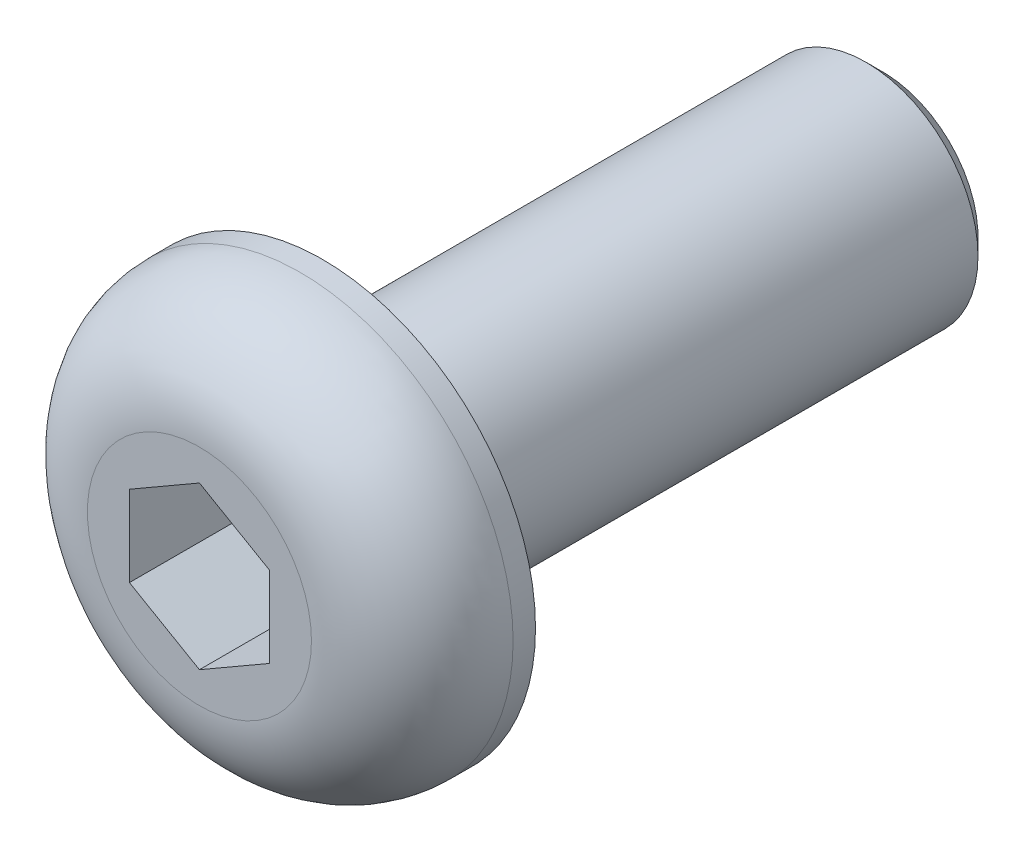
ISO-10303-21;
HEADER;
FILE_DESCRIPTION(('STEP AP214'),'2;1');
FILE_NAME('part.step','',(''),(''),'','','');
FILE_SCHEMA(('AUTOMOTIVE_DESIGN { 1 0 10303 214 1 1 1 1 }'));
ENDSEC;
DATA;
#1=APPLICATION_CONTEXT('core data for automotive mechanical design processes');
#2=APPLICATION_PROTOCOL_DEFINITION('international standard','automotive_design',2000,#1);
#3=PRODUCT_CONTEXT('',#1,'mechanical');
#4=PRODUCT('Part','Part','',(#3));
#5=PRODUCT_RELATED_PRODUCT_CATEGORY('part','',(#4));
#6=PRODUCT_DEFINITION_FORMATION('','',#4);
#7=PRODUCT_DEFINITION_CONTEXT('part definition',#1,'design');
#8=PRODUCT_DEFINITION('design','',#6,#7);
#9=PRODUCT_DEFINITION_SHAPE('','',#8);
#10=(LENGTH_UNIT() NAMED_UNIT(*) SI_UNIT(.MILLI.,.METRE.));
#11=(NAMED_UNIT(*) PLANE_ANGLE_UNIT() SI_UNIT($,.RADIAN.));
#12=(NAMED_UNIT(*) SI_UNIT($,.STERADIAN.) SOLID_ANGLE_UNIT());
#13=UNCERTAINTY_MEASURE_WITH_UNIT(LENGTH_MEASURE(1.E-05),#10,'distance_accuracy_value','');
#14=(GEOMETRIC_REPRESENTATION_CONTEXT(3) GLOBAL_UNCERTAINTY_ASSIGNED_CONTEXT((#13)) GLOBAL_UNIT_ASSIGNED_CONTEXT((#10,
#11,#12)) REPRESENTATION_CONTEXT('',''));
#15=CARTESIAN_POINT('',(0.,0.,0.));
#16=DIRECTION('',(0.,0.,1.));
#17=DIRECTION('',(1.,0.,0.));
#18=AXIS2_PLACEMENT_3D('',#15,#16,#17);
#19=CARTESIAN_POINT('',(0.,0.,0.));
#20=DIRECTION('',(0.,0.,1.));
#21=DIRECTION('',(1.,0.,0.));
#22=AXIS2_PLACEMENT_3D('',#19,#20,#21);
#23=PLANE('',#22);
#24=CARTESIAN_POINT('',(0.,0.,0.));
#25=DIRECTION('',(0.,0.,1.));
#26=DIRECTION('',(1.,0.,0.));
#27=AXIS2_PLACEMENT_3D('',#24,#25,#26);
#28=CIRCLE('',#27,3.8);
#29=CARTESIAN_POINT('',(3.8,0.,0.));
#30=VERTEX_POINT('',#29);
#31=EDGE_CURVE('E156',#30,#30,#28,.T.);
#32=ORIENTED_EDGE('',*,*,#31,.F.);
#33=EDGE_LOOP('',(#32));
#34=FACE_BOUND('',#33,.T.);
#35=CARTESIAN_POINT('',(0.,0.,0.));
#36=DIRECTION('',(0.,0.,1.));
#37=DIRECTION('',(1.,0.,0.));
#38=AXIS2_PLACEMENT_3D('',#35,#36,#37);
#39=CIRCLE('',#38,2.);
#40=CARTESIAN_POINT('',(2.,0.,0.));
#41=VERTEX_POINT('',#40);
#42=EDGE_CURVE('E166',#41,#41,#39,.F.);
#43=ORIENTED_EDGE('',*,*,#42,.F.);
#44=EDGE_LOOP('',(#43));
#45=FACE_BOUND('',#44,.T.);
#46=ADVANCED_FACE('F39',(#34,#45),#23,.F.);
#47=CARTESIAN_POINT('',(0.,0.,2.2));
#48=DIRECTION('',(0.,0.,-1.));
#49=DIRECTION('',(-1.,0.,0.));
#50=AXIS2_PLACEMENT_3D('',#47,#48,#49);
#51=CYLINDRICAL_SURFACE('',#50,3.8);
#52=CARTESIAN_POINT('',(0.,0.,0.4));
#53=DIRECTION('',(0.,0.,1.));
#54=DIRECTION('',(1.,0.,0.));
#55=AXIS2_PLACEMENT_3D('',#52,#53,#54);
#56=CIRCLE('',#55,3.8);
#57=CARTESIAN_POINT('',(3.8,0.,0.4));
#58=VERTEX_POINT('',#57);
#59=EDGE_CURVE('E11',#58,#58,#56,.F.);
#60=ORIENTED_EDGE('',*,*,#59,.T.);
#61=EDGE_LOOP('',(#60));
#62=FACE_BOUND('',#61,.T.);
#63=ORIENTED_EDGE('',*,*,#31,.T.);
#64=EDGE_LOOP('',(#63));
#65=FACE_BOUND('',#64,.T.);
#66=ADVANCED_FACE('F192',(#62,#65),#51,.T.);
#67=CARTESIAN_POINT('',(0.,0.,2.2));
#68=DIRECTION('',(0.,0.,1.));
#69=DIRECTION('',(1.,0.,0.));
#70=AXIS2_PLACEMENT_3D('',#67,#68,#69);
#71=PLANE('',#70);
#72=CARTESIAN_POINT('',(0.,0.,2.2));
#73=DIRECTION('',(0.,0.,1.));
#74=DIRECTION('',(1.,0.,0.));
#75=AXIS2_PLACEMENT_3D('',#72,#73,#74);
#76=CIRCLE('',#75,2.);
#77=CARTESIAN_POINT('',(2.,0.,2.2));
#78=VERTEX_POINT('',#77);
#79=EDGE_CURVE('E48',#78,#78,#76,.T.);
#80=ORIENTED_EDGE('',*,*,#79,.T.);
#81=EDGE_LOOP('',(#80));
#82=FACE_BOUND('',#81,.T.);
#83=DIRECTION('',(-0.866025403784439,0.5,0.));
#84=VECTOR('',#83,1.);
#85=CARTESIAN_POINT('',(1.25,0.721687836487033,2.2));
#86=LINE('',#85,#84);
#87=CARTESIAN_POINT('',(1.25,0.721687836487033,2.2));
#88=VERTEX_POINT('',#87);
#89=CARTESIAN_POINT('',(0.,1.44337567297406,2.2));
#90=VERTEX_POINT('',#89);
#91=EDGE_CURVE('E55',#88,#90,#86,.T.);
#92=ORIENTED_EDGE('',*,*,#91,.F.);
#93=DIRECTION('',(0.,1.,0.));
#94=VECTOR('',#93,1.);
#95=CARTESIAN_POINT('',(1.25,-0.721687836487033,2.2));
#96=LINE('',#95,#94);
#97=CARTESIAN_POINT('',(1.25,-0.721687836487033,2.2));
#98=VERTEX_POINT('',#97);
#99=EDGE_CURVE('E150',#98,#88,#96,.T.);
#100=ORIENTED_EDGE('',*,*,#99,.F.);
#101=DIRECTION('',(0.866025403784439,0.5,0.));
#102=VECTOR('',#101,1.);
#103=CARTESIAN_POINT('',(0.,-1.44337567297406,2.2));
#104=LINE('',#103,#102);
#105=CARTESIAN_POINT('',(0.,-1.44337567297406,2.2));
#106=VERTEX_POINT('',#105);
#107=EDGE_CURVE('E147',#106,#98,#104,.T.);
#108=ORIENTED_EDGE('',*,*,#107,.F.);
#109=DIRECTION('',(0.866025403784439,-0.5,0.));
#110=VECTOR('',#109,1.);
#111=CARTESIAN_POINT('',(-1.25,-0.721687836487032,2.2));
#112=LINE('',#111,#110);
#113=CARTESIAN_POINT('',(-1.25,-0.721687836487032,2.2));
#114=VERTEX_POINT('',#113);
#115=EDGE_CURVE('E108',#114,#106,#112,.T.);
#116=ORIENTED_EDGE('',*,*,#115,.F.);
#117=DIRECTION('',(0.,-1.,0.));
#118=VECTOR('',#117,1.);
#119=CARTESIAN_POINT('',(-1.25,0.721687836487033,2.2));
#120=LINE('',#119,#118);
#121=CARTESIAN_POINT('',(-1.25,0.721687836487033,2.2));
#122=VERTEX_POINT('',#121);
#123=EDGE_CURVE('E143',#122,#114,#120,.T.);
#124=ORIENTED_EDGE('',*,*,#123,.F.);
#125=DIRECTION('',(-0.866025403784439,-0.5,0.));
#126=VECTOR('',#125,1.);
#127=CARTESIAN_POINT('',(0.,1.44337567297406,2.2));
#128=LINE('',#127,#126);
#129=EDGE_CURVE('E140',#90,#122,#128,.T.);
#130=ORIENTED_EDGE('',*,*,#129,.F.);
#131=EDGE_LOOP('',(#92,#100,#108,#116,#124,#130));
#132=FACE_BOUND('',#131,.T.);
#133=ADVANCED_FACE('F180',(#82,#132),#71,.T.);
#134=CARTESIAN_POINT('',(0.,0.,-10.));
#135=DIRECTION('',(0.,0.,1.));
#136=DIRECTION('',(1.,0.,0.));
#137=AXIS2_PLACEMENT_3D('',#134,#135,#136);
#138=CYLINDRICAL_SURFACE('',#137,2.);
#139=CARTESIAN_POINT('',(0.,0.,-9.7));
#140=DIRECTION('',(0.,0.,-1.));
#141=DIRECTION('',(-1.,0.,0.));
#142=AXIS2_PLACEMENT_3D('',#139,#140,#141);
#143=CIRCLE('',#142,2.);
#144=CARTESIAN_POINT('',(-2.,0.,-9.7));
#145=VERTEX_POINT('',#144);
#146=EDGE_CURVE('E173',#145,#145,#143,.F.);
#147=ORIENTED_EDGE('',*,*,#146,.T.);
#148=EDGE_LOOP('',(#147));
#149=FACE_BOUND('',#148,.T.);
#150=ORIENTED_EDGE('',*,*,#42,.T.);
#151=EDGE_LOOP('',(#150));
#152=FACE_BOUND('',#151,.T.);
#153=ADVANCED_FACE('F215',(#149,#152),#138,.T.);
#154=CARTESIAN_POINT('',(0.,0.,-10.));
#155=DIRECTION('',(0.,0.,-1.));
#156=DIRECTION('',(-1.,0.,0.));
#157=AXIS2_PLACEMENT_3D('',#154,#155,#156);
#158=PLANE('',#157);
#159=CARTESIAN_POINT('',(0.,0.,-10.));
#160=DIRECTION('',(0.,0.,-1.));
#161=DIRECTION('',(-1.,0.,0.));
#162=AXIS2_PLACEMENT_3D('',#159,#160,#161);
#163=CIRCLE('',#162,1.7);
#164=CARTESIAN_POINT('',(-1.7,0.,-10.));
#165=VERTEX_POINT('',#164);
#166=EDGE_CURVE('E169',#165,#165,#163,.T.);
#167=ORIENTED_EDGE('',*,*,#166,.T.);
#168=EDGE_LOOP('',(#167));
#169=FACE_BOUND('',#168,.T.);
#170=ADVANCED_FACE('F207',(#169),#158,.T.);
#171=CARTESIAN_POINT('',(0.,0.,-10.));
#172=DIRECTION('',(0.,0.,1.));
#173=DIRECTION('',(1.,0.,0.));
#174=AXIS2_PLACEMENT_3D('',#171,#172,#173);
#175=CONICAL_SURFACE('',#174,1.7,0.785398163397448);
#176=ORIENTED_EDGE('',*,*,#146,.F.);
#177=EDGE_LOOP('',(#176));
#178=FACE_BOUND('',#177,.T.);
#179=ORIENTED_EDGE('',*,*,#166,.F.);
#180=EDGE_LOOP('',(#179));
#181=FACE_BOUND('',#180,.T.);
#182=ADVANCED_FACE('F204',(#178,#181),#175,.T.);
#183=CARTESIAN_POINT('',(1.25,0.721687836487033,0.2));
#184=DIRECTION('',(0.5,0.866025403784439,0.));
#185=DIRECTION('',(-0.866025403784439,0.5,0.));
#186=AXIS2_PLACEMENT_3D('',#183,#184,#185);
#187=PLANE('',#186);
#188=ORIENTED_EDGE('',*,*,#91,.T.);
#189=DIRECTION('',(0.,0.,1.));
#190=VECTOR('',#189,1.);
#191=CARTESIAN_POINT('',(0.,1.44337567297406,0.2));
#192=LINE('',#191,#190);
#193=CARTESIAN_POINT('',(0.,1.44337567297406,0.2));
#194=VERTEX_POINT('',#193);
#195=EDGE_CURVE('E90',#194,#90,#192,.T.);
#196=ORIENTED_EDGE('',*,*,#195,.F.);
#197=DIRECTION('',(-0.866025403784439,0.5,0.));
#198=VECTOR('',#197,1.);
#199=CARTESIAN_POINT('',(1.25,0.721687836487033,0.2));
#200=LINE('',#199,#198);
#201=CARTESIAN_POINT('',(1.25,0.721687836487033,0.2));
#202=VERTEX_POINT('',#201);
#203=EDGE_CURVE('E153',#202,#194,#200,.T.);
#204=ORIENTED_EDGE('',*,*,#203,.F.);
#205=DIRECTION('',(0.,0.,1.));
#206=VECTOR('',#205,1.);
#207=CARTESIAN_POINT('',(1.25,0.721687836487033,0.2));
#208=LINE('',#207,#206);
#209=EDGE_CURVE('E66',#202,#88,#208,.T.);
#210=ORIENTED_EDGE('',*,*,#209,.T.);
#211=EDGE_LOOP('',(#188,#196,#204,#210));
#212=FACE_BOUND('',#211,.T.);
#213=ADVANCED_FACE('F206',(#212),#187,.F.);
#214=CARTESIAN_POINT('',(1.25,-0.721687836487033,0.2));
#215=DIRECTION('',(1.,0.,0.));
#216=DIRECTION('',(0.,1.,0.));
#217=AXIS2_PLACEMENT_3D('',#214,#215,#216);
#218=PLANE('',#217);
#219=ORIENTED_EDGE('',*,*,#99,.T.);
#220=ORIENTED_EDGE('',*,*,#209,.F.);
#221=DIRECTION('',(0.,1.,0.));
#222=VECTOR('',#221,1.);
#223=CARTESIAN_POINT('',(1.25,-0.721687836487033,0.2));
#224=LINE('',#223,#222);
#225=CARTESIAN_POINT('',(1.25,-0.721687836487033,0.2));
#226=VERTEX_POINT('',#225);
#227=EDGE_CURVE('E122',#226,#202,#224,.T.);
#228=ORIENTED_EDGE('',*,*,#227,.F.);
#229=DIRECTION('',(0.,0.,1.));
#230=VECTOR('',#229,1.);
#231=CARTESIAN_POINT('',(1.25,-0.721687836487033,0.2));
#232=LINE('',#231,#230);
#233=EDGE_CURVE('E113',#226,#98,#232,.T.);
#234=ORIENTED_EDGE('',*,*,#233,.T.);
#235=EDGE_LOOP('',(#219,#220,#228,#234));
#236=FACE_BOUND('',#235,.T.);
#237=ADVANCED_FACE('F213',(#236),#218,.F.);
#238=CARTESIAN_POINT('',(0.,-1.44337567297406,0.2));
#239=DIRECTION('',(0.5,-0.866025403784439,0.));
#240=DIRECTION('',(0.866025403784439,0.5,0.));
#241=AXIS2_PLACEMENT_3D('',#238,#239,#240);
#242=PLANE('',#241);
#243=ORIENTED_EDGE('',*,*,#107,.T.);
#244=ORIENTED_EDGE('',*,*,#233,.F.);
#245=DIRECTION('',(0.866025403784439,0.5,0.));
#246=VECTOR('',#245,1.);
#247=CARTESIAN_POINT('',(0.,-1.44337567297406,0.2));
#248=LINE('',#247,#246);
#249=CARTESIAN_POINT('',(0.,-1.44337567297406,0.2));
#250=VERTEX_POINT('',#249);
#251=EDGE_CURVE('E117',#250,#226,#248,.T.);
#252=ORIENTED_EDGE('',*,*,#251,.F.);
#253=DIRECTION('',(0.,0.,1.));
#254=VECTOR('',#253,1.);
#255=CARTESIAN_POINT('',(0.,-1.44337567297406,0.2));
#256=LINE('',#255,#254);
#257=EDGE_CURVE('E101',#250,#106,#256,.T.);
#258=ORIENTED_EDGE('',*,*,#257,.T.);
#259=EDGE_LOOP('',(#243,#244,#252,#258));
#260=FACE_BOUND('',#259,.T.);
#261=ADVANCED_FACE('F118',(#260),#242,.F.);
#262=CARTESIAN_POINT('',(-1.25,-0.721687836487032,0.2));
#263=DIRECTION('',(-0.5,-0.866025403784439,0.));
#264=DIRECTION('',(0.866025403784439,-0.5,0.));
#265=AXIS2_PLACEMENT_3D('',#262,#263,#264);
#266=PLANE('',#265);
#267=ORIENTED_EDGE('',*,*,#115,.T.);
#268=ORIENTED_EDGE('',*,*,#257,.F.);
#269=DIRECTION('',(0.866025403784439,-0.5,0.));
#270=VECTOR('',#269,1.);
#271=CARTESIAN_POINT('',(-1.25,-0.721687836487032,0.2));
#272=LINE('',#271,#270);
#273=CARTESIAN_POINT('',(-1.25,-0.721687836487032,0.2));
#274=VERTEX_POINT('',#273);
#275=EDGE_CURVE('E105',#274,#250,#272,.T.);
#276=ORIENTED_EDGE('',*,*,#275,.F.);
#277=DIRECTION('',(0.,0.,1.));
#278=VECTOR('',#277,1.);
#279=CARTESIAN_POINT('',(-1.25,-0.721687836487032,0.2));
#280=LINE('',#279,#278);
#281=EDGE_CURVE('E114',#274,#114,#280,.T.);
#282=ORIENTED_EDGE('',*,*,#281,.T.);
#283=EDGE_LOOP('',(#267,#268,#276,#282));
#284=FACE_BOUND('',#283,.T.);
#285=ADVANCED_FACE('F103',(#284),#266,.F.);
#286=CARTESIAN_POINT('',(-1.25,0.721687836487033,0.2));
#287=DIRECTION('',(-1.,0.,0.));
#288=DIRECTION('',(0.,0.,1.));
#289=AXIS2_PLACEMENT_3D('',#286,#287,#288);
#290=PLANE('',#289);
#291=ORIENTED_EDGE('',*,*,#123,.T.);
#292=ORIENTED_EDGE('',*,*,#281,.F.);
#293=DIRECTION('',(0.,-1.,0.));
#294=VECTOR('',#293,1.);
#295=CARTESIAN_POINT('',(-1.25,0.721687836487033,0.2));
#296=LINE('',#295,#294);
#297=CARTESIAN_POINT('',(-1.25,0.721687836487033,0.2));
#298=VERTEX_POINT('',#297);
#299=EDGE_CURVE('E128',#298,#274,#296,.T.);
#300=ORIENTED_EDGE('',*,*,#299,.F.);
#301=DIRECTION('',(0.,0.,1.));
#302=VECTOR('',#301,1.);
#303=CARTESIAN_POINT('',(-1.25,0.721687836487033,0.2));
#304=LINE('',#303,#302);
#305=EDGE_CURVE('E160',#298,#122,#304,.T.);
#306=ORIENTED_EDGE('',*,*,#305,.T.);
#307=EDGE_LOOP('',(#291,#292,#300,#306));
#308=FACE_BOUND('',#307,.T.);
#309=ADVANCED_FACE('F231',(#308),#290,.F.);
#310=CARTESIAN_POINT('',(0.,1.44337567297406,0.2));
#311=DIRECTION('',(-0.5,0.866025403784439,0.));
#312=DIRECTION('',(-0.866025403784439,-0.5,0.));
#313=AXIS2_PLACEMENT_3D('',#310,#311,#312);
#314=PLANE('',#313);
#315=ORIENTED_EDGE('',*,*,#129,.T.);
#316=ORIENTED_EDGE('',*,*,#305,.F.);
#317=DIRECTION('',(-0.866025403784439,-0.5,0.));
#318=VECTOR('',#317,1.);
#319=CARTESIAN_POINT('',(0.,1.44337567297406,0.2));
#320=LINE('',#319,#318);
#321=EDGE_CURVE('E132',#194,#298,#320,.T.);
#322=ORIENTED_EDGE('',*,*,#321,.F.);
#323=ORIENTED_EDGE('',*,*,#195,.T.);
#324=EDGE_LOOP('',(#315,#316,#322,#323));
#325=FACE_BOUND('',#324,.T.);
#326=ADVANCED_FACE('F188',(#325),#314,.F.);
#327=CARTESIAN_POINT('',(0.,0.,0.2));
#328=DIRECTION('',(0.,0.,1.));
#329=DIRECTION('',(1.,0.,0.));
#330=AXIS2_PLACEMENT_3D('',#327,#328,#329);
#331=PLANE('',#330);
#332=ORIENTED_EDGE('',*,*,#203,.T.);
#333=ORIENTED_EDGE('',*,*,#321,.T.);
#334=ORIENTED_EDGE('',*,*,#299,.T.);
#335=ORIENTED_EDGE('',*,*,#275,.T.);
#336=ORIENTED_EDGE('',*,*,#251,.T.);
#337=ORIENTED_EDGE('',*,*,#227,.T.);
#338=EDGE_LOOP('',(#332,#333,#334,#335,#336,#337));
#339=FACE_BOUND('',#338,.T.);
#340=ADVANCED_FACE('F125',(#339),#331,.T.);
#341=CARTESIAN_POINT('',(0.,0.,0.4));
#342=DIRECTION('',(0.,0.,1.));
#343=DIRECTION('',(1.,0.,0.));
#344=AXIS2_PLACEMENT_3D('',#341,#342,#343);
#345=TOROIDAL_SURFACE('',#344,2.,1.8);
#346=ORIENTED_EDGE('',*,*,#59,.F.);
#347=EDGE_LOOP('',(#346));
#348=FACE_BOUND('',#347,.T.);
#349=ORIENTED_EDGE('',*,*,#79,.F.);
#350=EDGE_LOOP('',(#349));
#351=FACE_BOUND('',#350,.T.);
#352=ADVANCED_FACE('F41',(#348,#351),#345,.T.);
#353=CLOSED_SHELL('',(#46,#66,#133,#153,#170,#182,#213,#237,#261,#285,#309,#326,#340,#352));
#354=MANIFOLD_SOLID_BREP('B2',#353);
#355=ADVANCED_BREP_SHAPE_REPRESENTATION('',(#18,#354),#14);
#356=SHAPE_DEFINITION_REPRESENTATION(#9,#355);
ENDSEC;
END-ISO-10303-21;
